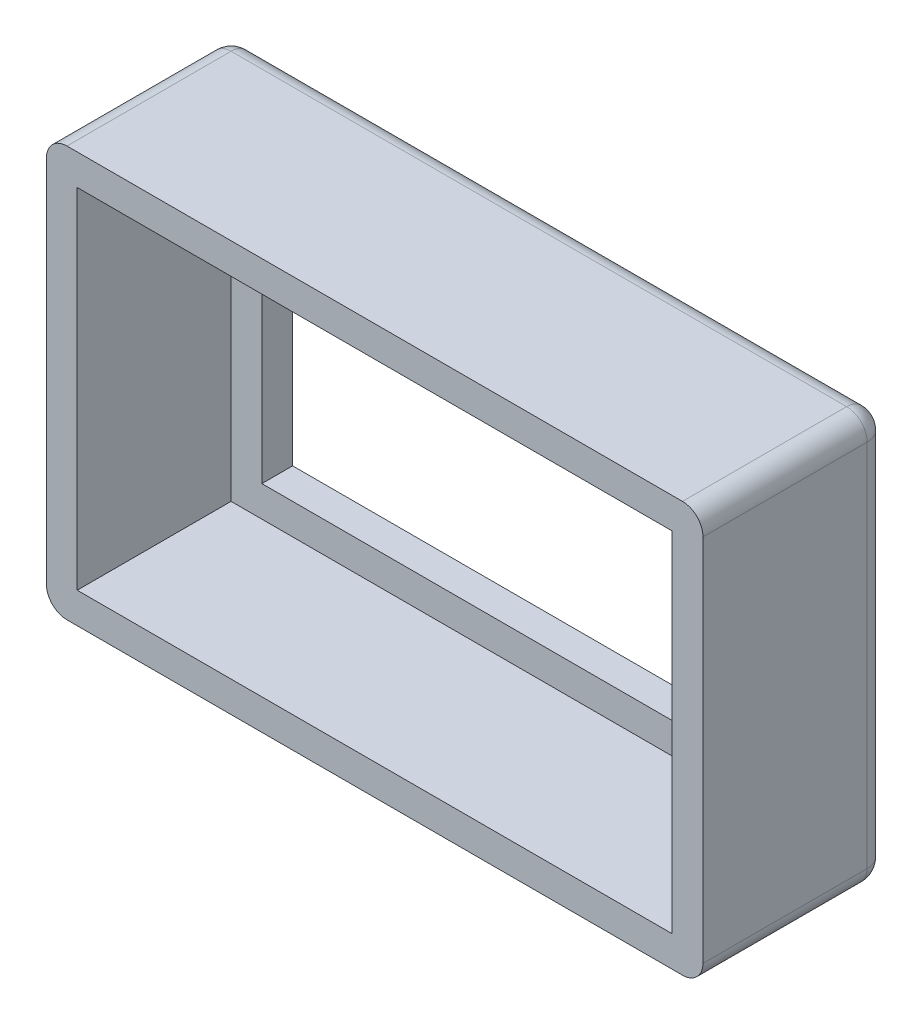
ISO-10303-21;
HEADER;
FILE_DESCRIPTION(('STEP AP214'),'2;1');
FILE_NAME('part.step','',(''),(''),'','','');
FILE_SCHEMA(('AUTOMOTIVE_DESIGN { 1 0 10303 214 1 1 1 1 }'));
ENDSEC;
DATA;
#1=APPLICATION_CONTEXT('core data for automotive mechanical design processes');
#2=APPLICATION_PROTOCOL_DEFINITION('international standard','automotive_design',2000,#1);
#3=PRODUCT_CONTEXT('',#1,'mechanical');
#4=PRODUCT('Part','Part','',(#3));
#5=PRODUCT_RELATED_PRODUCT_CATEGORY('part','',(#4));
#6=PRODUCT_DEFINITION_FORMATION('','',#4);
#7=PRODUCT_DEFINITION_CONTEXT('part definition',#1,'design');
#8=PRODUCT_DEFINITION('design','',#6,#7);
#9=PRODUCT_DEFINITION_SHAPE('','',#8);
#10=(LENGTH_UNIT() NAMED_UNIT(*) SI_UNIT(.MILLI.,.METRE.));
#11=(NAMED_UNIT(*) PLANE_ANGLE_UNIT() SI_UNIT($,.RADIAN.));
#12=(NAMED_UNIT(*) SI_UNIT($,.STERADIAN.) SOLID_ANGLE_UNIT());
#13=UNCERTAINTY_MEASURE_WITH_UNIT(LENGTH_MEASURE(1.E-05),#10,'distance_accuracy_value','');
#14=(GEOMETRIC_REPRESENTATION_CONTEXT(3) GLOBAL_UNCERTAINTY_ASSIGNED_CONTEXT((#13)) GLOBAL_UNIT_ASSIGNED_CONTEXT((#10,
#11,#12)) REPRESENTATION_CONTEXT('',''));
#15=CARTESIAN_POINT('',(0.,0.,0.));
#16=DIRECTION('',(0.,0.,1.));
#17=DIRECTION('',(1.,0.,0.));
#18=AXIS2_PLACEMENT_3D('',#15,#16,#17);
#19=CARTESIAN_POINT('',(29.4640000000033,-66.5479999999989,-4.57199999997471));
#20=DIRECTION('',(1.,0.,0.));
#21=DIRECTION('',(0.,0.,-1.));
#22=AXIS2_PLACEMENT_3D('',#19,#20,#21);
#23=PLANE('',#22);
#24=DIRECTION('',(0.,-1.,0.));
#25=VECTOR('',#24,1.);
#26=CARTESIAN_POINT('',(29.4640000000033,-66.5479999999912,-3.80999999998544));
#27=LINE('',#26,#25);
#28=CARTESIAN_POINT('',(29.4640000000033,-59.4359999999972,-3.80999999998988));
#29=VERTEX_POINT('',#28);
#30=CARTESIAN_POINT('',(29.4640000000033,-66.5479999999912,-3.80999999998544));
#31=VERTEX_POINT('',#30);
#32=EDGE_CURVE('E206',#29,#31,#27,.T.);
#33=ORIENTED_EDGE('',*,*,#32,.F.);
#34=DIRECTION('',(0.,0.,1.));
#35=VECTOR('',#34,1.);
#36=CARTESIAN_POINT('',(29.4640000000033,-59.4359999999909,-4.57199999998359));
#37=LINE('',#36,#35);
#38=CARTESIAN_POINT('',(29.4640000000033,-59.4359999999909,-4.57199999998359));
#39=VERTEX_POINT('',#38);
#40=EDGE_CURVE('E220',#39,#29,#37,.T.);
#41=ORIENTED_EDGE('',*,*,#40,.F.);
#42=DIRECTION('',(0.,1.,0.));
#43=VECTOR('',#42,1.);
#44=CARTESIAN_POINT('',(29.4640000000033,-66.5479999999989,-4.57199999997471));
#45=LINE('',#44,#43);
#46=CARTESIAN_POINT('',(29.4640000000033,-66.5479999999989,-4.57199999997471));
#47=VERTEX_POINT('',#46);
#48=EDGE_CURVE('E208',#47,#39,#45,.T.);
#49=ORIENTED_EDGE('',*,*,#48,.F.);
#50=DIRECTION('',(0.,0.,1.));
#51=VECTOR('',#50,1.);
#52=CARTESIAN_POINT('',(29.4640000000033,-66.5479999999989,-4.57199999997471));
#53=LINE('',#52,#51);
#54=EDGE_CURVE('E221',#47,#31,#53,.T.);
#55=ORIENTED_EDGE('',*,*,#54,.T.);
#56=EDGE_LOOP('',(#33,#41,#49,#55));
#57=FACE_BOUND('',#56,.T.);
#58=ADVANCED_FACE('F38',(#57),#23,.F.);
#59=CARTESIAN_POINT('',(16.2560000000033,-66.5479999999989,-4.57199999997471));
#60=DIRECTION('',(0.,-1.,0.));
#61=DIRECTION('',(0.,0.,-1.));
#62=AXIS2_PLACEMENT_3D('',#59,#60,#61);
#63=PLANE('',#62);
#64=DIRECTION('',(-1.,0.,0.));
#65=VECTOR('',#64,1.);
#66=CARTESIAN_POINT('',(16.2560000000033,-66.5479999999912,-3.80999999998544));
#67=LINE('',#66,#65);
#68=CARTESIAN_POINT('',(16.2560000000033,-66.5479999999912,-3.80999999998544));
#69=VERTEX_POINT('',#68);
#70=EDGE_CURVE('E204',#31,#69,#67,.T.);
#71=ORIENTED_EDGE('',*,*,#70,.F.);
#72=ORIENTED_EDGE('',*,*,#54,.F.);
#73=DIRECTION('',(1.,0.,0.));
#74=VECTOR('',#73,1.);
#75=CARTESIAN_POINT('',(16.2560000000033,-66.5479999999989,-4.57199999997471));
#76=LINE('',#75,#74);
#77=CARTESIAN_POINT('',(16.2560000000033,-66.5479999999989,-4.57199999997471));
#78=VERTEX_POINT('',#77);
#79=EDGE_CURVE('E217',#78,#47,#76,.T.);
#80=ORIENTED_EDGE('',*,*,#79,.F.);
#81=DIRECTION('',(0.,0.,1.));
#82=VECTOR('',#81,1.);
#83=CARTESIAN_POINT('',(16.2560000000033,-66.5479999999989,-4.57199999997471));
#84=LINE('',#83,#82);
#85=EDGE_CURVE('E225',#78,#69,#84,.T.);
#86=ORIENTED_EDGE('',*,*,#85,.T.);
#87=EDGE_LOOP('',(#71,#72,#80,#86));
#88=FACE_BOUND('',#87,.T.);
#89=ADVANCED_FACE('F341',(#88),#63,.F.);
#90=CARTESIAN_POINT('',(16.2560000000033,-59.4359999999909,-4.57199999998359));
#91=DIRECTION('',(-1.,0.,0.));
#92=DIRECTION('',(0.,0.,1.));
#93=AXIS2_PLACEMENT_3D('',#90,#91,#92);
#94=PLANE('',#93);
#95=DIRECTION('',(0.,1.,0.));
#96=VECTOR('',#95,1.);
#97=CARTESIAN_POINT('',(16.2560000000033,-59.4359999999972,-3.80999999998988));
#98=LINE('',#97,#96);
#99=CARTESIAN_POINT('',(16.2560000000033,-59.4359999999972,-3.80999999998988));
#100=VERTEX_POINT('',#99);
#101=EDGE_CURVE('E201',#69,#100,#98,.T.);
#102=ORIENTED_EDGE('',*,*,#101,.F.);
#103=ORIENTED_EDGE('',*,*,#85,.F.);
#104=DIRECTION('',(0.,-1.,0.));
#105=VECTOR('',#104,1.);
#106=CARTESIAN_POINT('',(16.2560000000033,-59.4359999999909,-4.57199999998359));
#107=LINE('',#106,#105);
#108=CARTESIAN_POINT('',(16.2560000000033,-59.4359999999909,-4.57199999998359));
#109=VERTEX_POINT('',#108);
#110=EDGE_CURVE('E214',#109,#78,#107,.T.);
#111=ORIENTED_EDGE('',*,*,#110,.F.);
#112=DIRECTION('',(0.,0.,1.));
#113=VECTOR('',#112,1.);
#114=CARTESIAN_POINT('',(16.2560000000033,-59.4359999999909,-4.57199999998359));
#115=LINE('',#114,#113);
#116=EDGE_CURVE('E228',#109,#100,#115,.T.);
#117=ORIENTED_EDGE('',*,*,#116,.T.);
#118=EDGE_LOOP('',(#102,#103,#111,#117));
#119=FACE_BOUND('',#118,.T.);
#120=ADVANCED_FACE('F347',(#119),#94,.F.);
#121=CARTESIAN_POINT('',(29.4640000000033,-59.4359999999909,-4.57199999998359));
#122=DIRECTION('',(0.,1.,0.));
#123=DIRECTION('',(-1.,0.,0.));
#124=AXIS2_PLACEMENT_3D('',#121,#122,#123);
#125=PLANE('',#124);
#126=DIRECTION('',(1.,0.,0.));
#127=VECTOR('',#126,1.);
#128=CARTESIAN_POINT('',(29.4640000000033,-59.4359999999972,-3.80999999998988));
#129=LINE('',#128,#127);
#130=EDGE_CURVE('E244',#100,#29,#129,.T.);
#131=ORIENTED_EDGE('',*,*,#130,.F.);
#132=ORIENTED_EDGE('',*,*,#116,.F.);
#133=DIRECTION('',(-1.,0.,0.));
#134=VECTOR('',#133,1.);
#135=CARTESIAN_POINT('',(29.4640000000033,-59.4359999999909,-4.57199999998359));
#136=LINE('',#135,#134);
#137=EDGE_CURVE('E211',#39,#109,#136,.T.);
#138=ORIENTED_EDGE('',*,*,#137,.F.);
#139=ORIENTED_EDGE('',*,*,#40,.T.);
#140=EDGE_LOOP('',(#131,#132,#138,#139));
#141=FACE_BOUND('',#140,.T.);
#142=ADVANCED_FACE('F352',(#141),#125,.F.);
#143=CARTESIAN_POINT('',(30.9880000000033,-68.0719999999919,-4.57199999998537));
#144=DIRECTION('',(1.,0.,0.));
#145=DIRECTION('',(0.,0.,-1.));
#146=AXIS2_PLACEMENT_3D('',#143,#144,#145);
#147=PLANE('',#146);
#148=DIRECTION('',(0.,1.,0.));
#149=VECTOR('',#148,1.);
#150=CARTESIAN_POINT('',(30.9880000000033,-57.9120000000009,-4.06399999999518));
#151=LINE('',#150,#149);
#152=CARTESIAN_POINT('',(30.9880000000033,-67.563999999994,-4.06399999999074));
#153=VERTEX_POINT('',#152);
#154=CARTESIAN_POINT('',(30.9880000000033,-58.4199999999973,-4.06399999999785));
#155=VERTEX_POINT('',#154);
#156=EDGE_CURVE('E248',#153,#155,#151,.T.);
#157=ORIENTED_EDGE('',*,*,#156,.T.);
#158=DIRECTION('',(0.,0.,1.));
#159=VECTOR('',#158,1.);
#160=CARTESIAN_POINT('',(30.9880000000033,-58.4199999999999,-4.57199999999247));
#161=LINE('',#160,#159);
#162=CARTESIAN_POINT('',(30.9880000000033,-58.4199999999937,8.88178419700125E-13));
#163=VERTEX_POINT('',#162);
#164=EDGE_CURVE('E251',#155,#163,#161,.T.);
#165=ORIENTED_EDGE('',*,*,#164,.T.);
#166=DIRECTION('',(0.,1.,0.));
#167=VECTOR('',#166,1.);
#168=CARTESIAN_POINT('',(30.9880000000033,-68.0719999999984,4.44089209850063E-12));
#169=LINE('',#168,#167);
#170=CARTESIAN_POINT('',(30.9880000000033,-67.5639999999948,8.88178419700125E-13));
#171=VERTEX_POINT('',#170);
#172=EDGE_CURVE('E224',#171,#163,#169,.T.);
#173=ORIENTED_EDGE('',*,*,#172,.F.);
#174=DIRECTION('',(0.,0.,1.));
#175=VECTOR('',#174,1.);
#176=CARTESIAN_POINT('',(30.9880000000033,-67.5639999999962,-4.57199999999425));
#177=LINE('',#176,#175);
#178=EDGE_CURVE('E246',#171,#153,#177,.F.);
#179=ORIENTED_EDGE('',*,*,#178,.T.);
#180=EDGE_LOOP('',(#157,#165,#173,#179));
#181=FACE_BOUND('',#180,.T.);
#182=ADVANCED_FACE('F365',(#181),#147,.T.);
#183=CARTESIAN_POINT('',(14.7320000000033,-68.0719999999919,-4.57199999998537));
#184=DIRECTION('',(0.,-1.,0.));
#185=DIRECTION('',(0.,0.,-1.));
#186=AXIS2_PLACEMENT_3D('',#183,#184,#185);
#187=PLANE('',#186);
#188=DIRECTION('',(1.,0.,0.));
#189=VECTOR('',#188,1.);
#190=CARTESIAN_POINT('',(14.7320000000033,-68.0719999999984,4.44089209850063E-12));
#191=LINE('',#190,#189);
#192=CARTESIAN_POINT('',(15.2400000000033,-68.0719999999984,4.44089209850063E-12));
#193=VERTEX_POINT('',#192);
#194=CARTESIAN_POINT('',(30.4800000000033,-68.0719999999984,4.44089209850063E-12));
#195=VERTEX_POINT('',#194);
#196=EDGE_CURVE('E241',#193,#195,#191,.T.);
#197=ORIENTED_EDGE('',*,*,#196,.F.);
#198=DIRECTION('',(0.,0.,1.));
#199=VECTOR('',#198,1.);
#200=CARTESIAN_POINT('',(15.2400000000033,-68.0719999999919,-4.57199999998537));
#201=LINE('',#200,#199);
#202=CARTESIAN_POINT('',(15.2400000000033,-68.0719999999977,-4.06399999999785));
#203=VERTEX_POINT('',#202);
#204=EDGE_CURVE('E55',#193,#203,#201,.F.);
#205=ORIENTED_EDGE('',*,*,#204,.T.);
#206=DIRECTION('',(1.,0.,0.));
#207=VECTOR('',#206,1.);
#208=CARTESIAN_POINT('',(30.9880000000033,-68.0719999999977,-4.06399999999785));
#209=LINE('',#208,#207);
#210=CARTESIAN_POINT('',(30.4800000000033,-68.0719999999977,-4.06399999999785));
#211=VERTEX_POINT('',#210);
#212=EDGE_CURVE('E60',#203,#211,#209,.T.);
#213=ORIENTED_EDGE('',*,*,#212,.T.);
#214=DIRECTION('',(0.,0.,1.));
#215=VECTOR('',#214,1.);
#216=CARTESIAN_POINT('',(30.4800000000033,-68.0719999999919,-4.57199999998537));
#217=LINE('',#216,#215);
#218=EDGE_CURVE('E274',#211,#195,#217,.T.);
#219=ORIENTED_EDGE('',*,*,#218,.T.);
#220=EDGE_LOOP('',(#197,#205,#213,#219));
#221=FACE_BOUND('',#220,.T.);
#222=ADVANCED_FACE('F361',(#221),#187,.T.);
#223=CARTESIAN_POINT('',(14.7320000000033,-57.9119999999982,-4.57199999999425));
#224=DIRECTION('',(-1.,0.,0.));
#225=DIRECTION('',(0.,-1.,0.));
#226=AXIS2_PLACEMENT_3D('',#223,#224,#225);
#227=PLANE('',#226);
#228=DIRECTION('',(0.,-1.,0.));
#229=VECTOR('',#228,1.);
#230=CARTESIAN_POINT('',(14.7320000000033,-57.9119999999991,-8.88178419700125E-13));
#231=LINE('',#230,#229);
#232=CARTESIAN_POINT('',(14.7320000000033,-58.4199999999937,8.88178419700125E-13));
#233=VERTEX_POINT('',#232);
#234=CARTESIAN_POINT('',(14.7320000000033,-67.5639999999948,8.88178419700125E-13));
#235=VERTEX_POINT('',#234);
#236=EDGE_CURVE('E238',#233,#235,#231,.T.);
#237=ORIENTED_EDGE('',*,*,#236,.F.);
#238=DIRECTION('',(0.,0.,1.));
#239=VECTOR('',#238,1.);
#240=CARTESIAN_POINT('',(14.7320000000033,-58.4199999999999,-4.57199999999247));
#241=LINE('',#240,#239);
#242=CARTESIAN_POINT('',(14.7320000000033,-58.4199999999973,-4.06399999999607));
#243=VERTEX_POINT('',#242);
#244=EDGE_CURVE('E272',#233,#243,#241,.F.);
#245=ORIENTED_EDGE('',*,*,#244,.T.);
#246=DIRECTION('',(0.,-1.,0.));
#247=VECTOR('',#246,1.);
#248=CARTESIAN_POINT('',(14.7320000000033,-68.0719999999977,-4.06399999999785));
#249=LINE('',#248,#247);
#250=CARTESIAN_POINT('',(14.7320000000033,-67.563999999994,-4.06399999999074));
#251=VERTEX_POINT('',#250);
#252=EDGE_CURVE('E270',#243,#251,#249,.T.);
#253=ORIENTED_EDGE('',*,*,#252,.T.);
#254=DIRECTION('',(0.,0.,1.));
#255=VECTOR('',#254,1.);
#256=CARTESIAN_POINT('',(14.7320000000033,-67.5639999999962,-4.57199999999425));
#257=LINE('',#256,#255);
#258=EDGE_CURVE('E268',#251,#235,#257,.T.);
#259=ORIENTED_EDGE('',*,*,#258,.T.);
#260=EDGE_LOOP('',(#237,#245,#253,#259));
#261=FACE_BOUND('',#260,.T.);
#262=ADVANCED_FACE('F364',(#261),#227,.T.);
#263=CARTESIAN_POINT('',(30.9880000000033,-57.9119999999982,-4.57199999999425));
#264=DIRECTION('',(0.,1.,0.));
#265=DIRECTION('',(-1.,0.,0.));
#266=AXIS2_PLACEMENT_3D('',#263,#264,#265);
#267=PLANE('',#266);
#268=DIRECTION('',(-1.,0.,0.));
#269=VECTOR('',#268,1.);
#270=CARTESIAN_POINT('',(14.7320000000033,-57.9120000000009,-4.06399999999607));
#271=LINE('',#270,#269);
#272=CARTESIAN_POINT('',(30.4800000000033,-57.9120000000009,-4.06399999999518));
#273=VERTEX_POINT('',#272);
#274=CARTESIAN_POINT('',(15.2400000000033,-57.9120000000009,-4.06399999999607));
#275=VERTEX_POINT('',#274);
#276=EDGE_CURVE('E264',#273,#275,#271,.T.);
#277=ORIENTED_EDGE('',*,*,#276,.T.);
#278=DIRECTION('',(0.,0.,1.));
#279=VECTOR('',#278,1.);
#280=CARTESIAN_POINT('',(15.2400000000033,-57.9119999999982,-4.57199999999425));
#281=LINE('',#280,#279);
#282=CARTESIAN_POINT('',(15.2400000000033,-57.9119999999991,-8.88178419700125E-13));
#283=VERTEX_POINT('',#282);
#284=EDGE_CURVE('E266',#275,#283,#281,.T.);
#285=ORIENTED_EDGE('',*,*,#284,.T.);
#286=DIRECTION('',(-1.,0.,0.));
#287=VECTOR('',#286,1.);
#288=CARTESIAN_POINT('',(30.9880000000033,-57.9119999999991,-8.88178419700125E-13));
#289=LINE('',#288,#287);
#290=CARTESIAN_POINT('',(30.4800000000033,-57.9119999999991,-8.88178419700125E-13));
#291=VERTEX_POINT('',#290);
#292=EDGE_CURVE('E235',#291,#283,#289,.T.);
#293=ORIENTED_EDGE('',*,*,#292,.F.);
#294=DIRECTION('',(0.,0.,1.));
#295=VECTOR('',#294,1.);
#296=CARTESIAN_POINT('',(30.4800000000033,-57.9119999999982,-4.57199999999425));
#297=LINE('',#296,#295);
#298=EDGE_CURVE('E262',#291,#273,#297,.F.);
#299=ORIENTED_EDGE('',*,*,#298,.T.);
#300=EDGE_LOOP('',(#277,#285,#293,#299));
#301=FACE_BOUND('',#300,.T.);
#302=ADVANCED_FACE('F357',(#301),#267,.T.);
#303=CARTESIAN_POINT('',(-4.44089209850063E-13,-8.88178419700125E-13,-4.57199999999158));
#304=DIRECTION('',(0.,0.,1.));
#305=DIRECTION('',(1.,0.,0.));
#306=AXIS2_PLACEMENT_3D('',#303,#304,#305);
#307=PLANE('',#306);
#308=DIRECTION('',(-1.,0.,0.));
#309=VECTOR('',#308,1.);
#310=CARTESIAN_POINT('',(30.9880000000033,-58.4199999999999,-4.57199999999247));
#311=LINE('',#310,#309);
#312=CARTESIAN_POINT('',(15.2400000000033,-58.4199999999999,-4.57199999999247));
#313=VERTEX_POINT('',#312);
#314=CARTESIAN_POINT('',(30.4800000000033,-58.4199999999999,-4.57199999999247));
#315=VERTEX_POINT('',#314);
#316=EDGE_CURVE('E257',#313,#315,#311,.F.);
#317=ORIENTED_EDGE('',*,*,#316,.T.);
#318=DIRECTION('',(0.,1.,0.));
#319=VECTOR('',#318,1.);
#320=CARTESIAN_POINT('',(30.4800000000033,-68.0719999999919,-4.57199999998537));
#321=LINE('',#320,#319);
#322=CARTESIAN_POINT('',(30.4800000000033,-67.5639999999962,-4.57199999999425));
#323=VERTEX_POINT('',#322);
#324=EDGE_CURVE('E259',#315,#323,#321,.F.);
#325=ORIENTED_EDGE('',*,*,#324,.T.);
#326=DIRECTION('',(1.,0.,0.));
#327=VECTOR('',#326,1.);
#328=CARTESIAN_POINT('',(14.7320000000033,-67.5639999999962,-4.57199999999425));
#329=LINE('',#328,#327);
#330=CARTESIAN_POINT('',(15.2400000000033,-67.5639999999962,-4.57199999999425));
#331=VERTEX_POINT('',#330);
#332=EDGE_CURVE('E253',#323,#331,#329,.F.);
#333=ORIENTED_EDGE('',*,*,#332,.T.);
#334=DIRECTION('',(0.,-1.,0.));
#335=VECTOR('',#334,1.);
#336=CARTESIAN_POINT('',(15.2400000000033,-57.9119999999982,-4.57199999999425));
#337=LINE('',#336,#335);
#338=EDGE_CURVE('E255',#331,#313,#337,.F.);
#339=ORIENTED_EDGE('',*,*,#338,.T.);
#340=EDGE_LOOP('',(#317,#325,#333,#339));
#341=FACE_BOUND('',#340,.T.);
#342=ORIENTED_EDGE('',*,*,#79,.T.);
#343=ORIENTED_EDGE('',*,*,#48,.T.);
#344=ORIENTED_EDGE('',*,*,#137,.T.);
#345=ORIENTED_EDGE('',*,*,#110,.T.);
#346=EDGE_LOOP('',(#342,#343,#344,#345));
#347=FACE_BOUND('',#346,.T.);
#348=ADVANCED_FACE('F354',(#341,#347),#307,.F.);
#349=CARTESIAN_POINT('',(0.,0.,0.));
#350=DIRECTION('',(0.,0.,1.));
#351=DIRECTION('',(1.,0.,0.));
#352=AXIS2_PLACEMENT_3D('',#349,#350,#351);
#353=PLANE('',#352);
#354=DIRECTION('',(0.,-1.,0.));
#355=VECTOR('',#354,1.);
#356=CARTESIAN_POINT('',(15.4940000000033,-58.673999999999,0.));
#357=LINE('',#356,#355);
#358=CARTESIAN_POINT('',(15.4940000000033,-58.673999999999,0.));
#359=VERTEX_POINT('',#358);
#360=CARTESIAN_POINT('',(15.4940000000033,-67.3099999999991,0.));
#361=VERTEX_POINT('',#360);
#362=EDGE_CURVE('E185',#359,#361,#357,.T.);
#363=ORIENTED_EDGE('',*,*,#362,.F.);
#364=DIRECTION('',(-1.,0.,0.));
#365=VECTOR('',#364,1.);
#366=CARTESIAN_POINT('',(15.4940000000033,-58.673999999999,0.));
#367=LINE('',#366,#365);
#368=CARTESIAN_POINT('',(30.2260000000033,-58.673999999999,0.));
#369=VERTEX_POINT('',#368);
#370=EDGE_CURVE('E190',#369,#359,#367,.T.);
#371=ORIENTED_EDGE('',*,*,#370,.F.);
#372=DIRECTION('',(0.,1.,0.));
#373=VECTOR('',#372,1.);
#374=CARTESIAN_POINT('',(30.2260000000033,-58.673999999999,0.));
#375=LINE('',#374,#373);
#376=CARTESIAN_POINT('',(30.2260000000033,-67.3099999999991,0.));
#377=VERTEX_POINT('',#376);
#378=EDGE_CURVE('E169',#377,#369,#375,.T.);
#379=ORIENTED_EDGE('',*,*,#378,.F.);
#380=DIRECTION('',(1.,0.,0.));
#381=VECTOR('',#380,1.);
#382=CARTESIAN_POINT('',(15.4940000000033,-67.3099999999991,0.));
#383=LINE('',#382,#381);
#384=EDGE_CURVE('E180',#361,#377,#383,.T.);
#385=ORIENTED_EDGE('',*,*,#384,.F.);
#386=EDGE_LOOP('',(#363,#371,#379,#385));
#387=FACE_BOUND('',#386,.T.);
#388=ORIENTED_EDGE('',*,*,#292,.T.);
#389=CARTESIAN_POINT('',(15.2400000000033,-58.4199999999937,8.88178419700125E-13));
#390=DIRECTION('',(0.,0.,1.));
#391=DIRECTION('',(1.,0.,0.));
#392=AXIS2_PLACEMENT_3D('',#389,#390,#391);
#393=CIRCLE('',#392,0.508);
#394=EDGE_CURVE('E12',#283,#233,#393,.T.);
#395=ORIENTED_EDGE('',*,*,#394,.T.);
#396=ORIENTED_EDGE('',*,*,#236,.T.);
#397=CARTESIAN_POINT('',(15.2400000000033,-67.5639999999948,8.88178419700125E-13));
#398=DIRECTION('',(0.,0.,1.));
#399=DIRECTION('',(1.,0.,0.));
#400=AXIS2_PLACEMENT_3D('',#397,#398,#399);
#401=CIRCLE('',#400,0.508);
#402=EDGE_CURVE('E280',#235,#193,#401,.T.);
#403=ORIENTED_EDGE('',*,*,#402,.T.);
#404=ORIENTED_EDGE('',*,*,#196,.T.);
#405=CARTESIAN_POINT('',(30.4800000000033,-67.5639999999948,8.88178419700125E-13));
#406=DIRECTION('',(0.,0.,1.));
#407=DIRECTION('',(1.,0.,0.));
#408=AXIS2_PLACEMENT_3D('',#405,#406,#407);
#409=CIRCLE('',#408,0.508);
#410=EDGE_CURVE('E278',#195,#171,#409,.T.);
#411=ORIENTED_EDGE('',*,*,#410,.T.);
#412=ORIENTED_EDGE('',*,*,#172,.T.);
#413=CARTESIAN_POINT('',(30.4800000000033,-58.4199999999937,8.88178419700125E-13));
#414=DIRECTION('',(0.,0.,1.));
#415=DIRECTION('',(1.,0.,0.));
#416=AXIS2_PLACEMENT_3D('',#413,#414,#415);
#417=CIRCLE('',#416,0.508);
#418=EDGE_CURVE('E47',#163,#291,#417,.T.);
#419=ORIENTED_EDGE('',*,*,#418,.T.);
#420=EDGE_LOOP('',(#388,#395,#396,#403,#404,#411,#412,#419));
#421=FACE_BOUND('',#420,.T.);
#422=ADVANCED_FACE('F187',(#387,#421),#353,.T.);
#423=CARTESIAN_POINT('',(-2.22044604925031E-13,5.32907051820075E-12,-3.80999999999787));
#424=DIRECTION('',(0.,0.,1.));
#425=DIRECTION('',(1.,0.,0.));
#426=AXIS2_PLACEMENT_3D('',#423,#424,#425);
#427=PLANE('',#426);
#428=DIRECTION('',(0.,1.,0.));
#429=VECTOR('',#428,1.);
#430=CARTESIAN_POINT('',(15.4940000000033,-58.6739999999963,-3.80999999999609));
#431=LINE('',#430,#429);
#432=CARTESIAN_POINT('',(15.4940000000033,-67.3099999999911,-3.80999999997833));
#433=VERTEX_POINT('',#432);
#434=CARTESIAN_POINT('',(15.4940000000033,-58.6739999999963,-3.80999999999609));
#435=VERTEX_POINT('',#434);
#436=EDGE_CURVE('E202',#433,#435,#431,.T.);
#437=ORIENTED_EDGE('',*,*,#436,.F.);
#438=DIRECTION('',(-1.,0.,0.));
#439=VECTOR('',#438,1.);
#440=CARTESIAN_POINT('',(15.4940000000033,-67.3099999999911,-3.80999999997833));
#441=LINE('',#440,#439);
#442=CARTESIAN_POINT('',(30.2260000000033,-67.3099999999911,-3.80999999997833));
#443=VERTEX_POINT('',#442);
#444=EDGE_CURVE('E199',#443,#433,#441,.T.);
#445=ORIENTED_EDGE('',*,*,#444,.F.);
#446=DIRECTION('',(0.,-1.,0.));
#447=VECTOR('',#446,1.);
#448=CARTESIAN_POINT('',(30.2260000000033,-58.6739999999963,-3.80999999999609));
#449=LINE('',#448,#447);
#450=CARTESIAN_POINT('',(30.2260000000033,-58.6739999999963,-3.80999999999609));
#451=VERTEX_POINT('',#450);
#452=EDGE_CURVE('E172',#451,#443,#449,.T.);
#453=ORIENTED_EDGE('',*,*,#452,.F.);
#454=DIRECTION('',(1.,0.,0.));
#455=VECTOR('',#454,1.);
#456=CARTESIAN_POINT('',(15.4940000000033,-58.6739999999963,-3.80999999999609));
#457=LINE('',#456,#455);
#458=EDGE_CURVE('E319',#435,#451,#457,.T.);
#459=ORIENTED_EDGE('',*,*,#458,.F.);
#460=EDGE_LOOP('',(#437,#445,#453,#459));
#461=FACE_BOUND('',#460,.T.);
#462=ORIENTED_EDGE('',*,*,#32,.T.);
#463=ORIENTED_EDGE('',*,*,#70,.T.);
#464=ORIENTED_EDGE('',*,*,#101,.T.);
#465=ORIENTED_EDGE('',*,*,#130,.T.);
#466=EDGE_LOOP('',(#462,#463,#464,#465));
#467=FACE_BOUND('',#466,.T.);
#468=ADVANCED_FACE('F327',(#461,#467),#427,.T.);
#469=CARTESIAN_POINT('',(15.4940000000033,-58.6739999999937,-21.6486600949937));
#470=DIRECTION('',(-1.,0.,0.));
#471=DIRECTION('',(0.,-1.,0.));
#472=AXIS2_PLACEMENT_3D('',#469,#470,#471);
#473=PLANE('',#472);
#474=ORIENTED_EDGE('',*,*,#436,.T.);
#475=DIRECTION('',(0.,0.,1.));
#476=VECTOR('',#475,1.);
#477=CARTESIAN_POINT('',(15.4940000000033,-58.6739999999937,-21.6486600949937));
#478=LINE('',#477,#476);
#479=EDGE_CURVE('E195',#435,#359,#478,.T.);
#480=ORIENTED_EDGE('',*,*,#479,.T.);
#481=ORIENTED_EDGE('',*,*,#362,.T.);
#482=DIRECTION('',(0.,0.,1.));
#483=VECTOR('',#482,1.);
#484=CARTESIAN_POINT('',(15.4940000000033,-67.3099999999991,-21.6486600949928));
#485=LINE('',#484,#483);
#486=EDGE_CURVE('E176',#433,#361,#485,.T.);
#487=ORIENTED_EDGE('',*,*,#486,.F.);
#488=EDGE_LOOP('',(#474,#480,#481,#487));
#489=FACE_BOUND('',#488,.T.);
#490=ADVANCED_FACE('F329',(#489),#473,.F.);
#491=CARTESIAN_POINT('',(15.4940000000033,-58.6739999999937,-21.6486600949937));
#492=DIRECTION('',(0.,1.,0.));
#493=DIRECTION('',(0.,0.,1.));
#494=AXIS2_PLACEMENT_3D('',#491,#492,#493);
#495=PLANE('',#494);
#496=ORIENTED_EDGE('',*,*,#458,.T.);
#497=DIRECTION('',(0.,0.,1.));
#498=VECTOR('',#497,1.);
#499=CARTESIAN_POINT('',(30.2260000000033,-58.6739999999937,-21.6486600949937));
#500=LINE('',#499,#498);
#501=EDGE_CURVE('E175',#451,#369,#500,.T.);
#502=ORIENTED_EDGE('',*,*,#501,.T.);
#503=ORIENTED_EDGE('',*,*,#370,.T.);
#504=ORIENTED_EDGE('',*,*,#479,.F.);
#505=EDGE_LOOP('',(#496,#502,#503,#504));
#506=FACE_BOUND('',#505,.T.);
#507=ADVANCED_FACE('F324',(#506),#495,.F.);
#508=CARTESIAN_POINT('',(30.2260000000033,-58.6739999999937,-21.6486600949937));
#509=DIRECTION('',(1.,0.,0.));
#510=DIRECTION('',(0.,1.,0.));
#511=AXIS2_PLACEMENT_3D('',#508,#509,#510);
#512=PLANE('',#511);
#513=ORIENTED_EDGE('',*,*,#452,.T.);
#514=DIRECTION('',(0.,0.,1.));
#515=VECTOR('',#514,1.);
#516=CARTESIAN_POINT('',(30.2260000000033,-67.3099999999991,-21.6486600949928));
#517=LINE('',#516,#515);
#518=EDGE_CURVE('E164',#443,#377,#517,.T.);
#519=ORIENTED_EDGE('',*,*,#518,.T.);
#520=ORIENTED_EDGE('',*,*,#378,.T.);
#521=ORIENTED_EDGE('',*,*,#501,.F.);
#522=EDGE_LOOP('',(#513,#519,#520,#521));
#523=FACE_BOUND('',#522,.T.);
#524=ADVANCED_FACE('F166',(#523),#512,.F.);
#525=CARTESIAN_POINT('',(15.4940000000033,-67.3099999999991,-21.6486600949928));
#526=DIRECTION('',(0.,-1.,0.));
#527=DIRECTION('',(1.,0.,0.));
#528=AXIS2_PLACEMENT_3D('',#525,#526,#527);
#529=PLANE('',#528);
#530=ORIENTED_EDGE('',*,*,#444,.T.);
#531=ORIENTED_EDGE('',*,*,#486,.T.);
#532=ORIENTED_EDGE('',*,*,#384,.T.);
#533=ORIENTED_EDGE('',*,*,#518,.F.);
#534=EDGE_LOOP('',(#530,#531,#532,#533));
#535=FACE_BOUND('',#534,.T.);
#536=ADVANCED_FACE('F181',(#535),#529,.F.);
#537=CARTESIAN_POINT('',(15.2400000000033,-67.5639999999962,-4.57199999999425));
#538=DIRECTION('',(0.,0.,1.));
#539=DIRECTION('',(1.,0.,0.));
#540=AXIS2_PLACEMENT_3D('',#537,#538,#539);
#541=CYLINDRICAL_SURFACE('',#540,0.508);
#542=ORIENTED_EDGE('',*,*,#402,.F.);
#543=ORIENTED_EDGE('',*,*,#258,.F.);
#544=CARTESIAN_POINT('',(15.2400000000033,-67.563999999994,-4.06399999999074));
#545=DIRECTION('',(0.,0.,-1.));
#546=DIRECTION('',(-1.,0.,0.));
#547=AXIS2_PLACEMENT_3D('',#544,#545,#546);
#548=CIRCLE('',#547,0.508);
#549=EDGE_CURVE('E310',#203,#251,#548,.T.);
#550=ORIENTED_EDGE('',*,*,#549,.F.);
#551=ORIENTED_EDGE('',*,*,#204,.F.);
#552=EDGE_LOOP('',(#542,#543,#550,#551));
#553=FACE_BOUND('',#552,.T.);
#554=ADVANCED_FACE('F40',(#553),#541,.T.);
#555=CARTESIAN_POINT('',(15.2400000000033,-58.4199999999999,-4.57199999999247));
#556=DIRECTION('',(0.,0.,1.));
#557=DIRECTION('',(1.,0.,0.));
#558=AXIS2_PLACEMENT_3D('',#555,#556,#557);
#559=CYLINDRICAL_SURFACE('',#558,0.508);
#560=ORIENTED_EDGE('',*,*,#394,.F.);
#561=ORIENTED_EDGE('',*,*,#284,.F.);
#562=CARTESIAN_POINT('',(15.2400000000033,-58.4199999999973,-4.06399999999607));
#563=DIRECTION('',(0.,0.,-1.));
#564=DIRECTION('',(-1.,0.,0.));
#565=AXIS2_PLACEMENT_3D('',#562,#563,#564);
#566=CIRCLE('',#565,0.508);
#567=EDGE_CURVE('E308',#243,#275,#566,.T.);
#568=ORIENTED_EDGE('',*,*,#567,.F.);
#569=ORIENTED_EDGE('',*,*,#244,.F.);
#570=EDGE_LOOP('',(#560,#561,#568,#569));
#571=FACE_BOUND('',#570,.T.);
#572=ADVANCED_FACE('F412',(#571),#559,.T.);
#573=CARTESIAN_POINT('',(15.2400000000033,-57.9120000000009,-4.06399999999607));
#574=DIRECTION('',(0.,1.,0.));
#575=DIRECTION('',(-1.,0.,0.));
#576=AXIS2_PLACEMENT_3D('',#573,#574,#575);
#577=CYLINDRICAL_SURFACE('',#576,0.508);
#578=CARTESIAN_POINT('',(15.2400000000033,-67.563999999994,-4.06399999999074));
#579=DIRECTION('',(0.,-1.,0.));
#580=DIRECTION('',(0.,0.,-1.));
#581=AXIS2_PLACEMENT_3D('',#578,#579,#580);
#582=CIRCLE('',#581,0.508);
#583=EDGE_CURVE('E42',#251,#331,#582,.T.);
#584=ORIENTED_EDGE('',*,*,#583,.F.);
#585=ORIENTED_EDGE('',*,*,#252,.F.);
#586=CARTESIAN_POINT('',(15.2400000000033,-58.4199999999973,-4.06399999999607));
#587=DIRECTION('',(0.,1.,0.));
#588=DIRECTION('',(0.,0.,1.));
#589=AXIS2_PLACEMENT_3D('',#586,#587,#588);
#590=CIRCLE('',#589,0.508);
#591=EDGE_CURVE('E305',#313,#243,#590,.T.);
#592=ORIENTED_EDGE('',*,*,#591,.F.);
#593=ORIENTED_EDGE('',*,*,#338,.F.);
#594=EDGE_LOOP('',(#584,#585,#592,#593));
#595=FACE_BOUND('',#594,.T.);
#596=ADVANCED_FACE('F410',(#595),#577,.T.);
#597=CARTESIAN_POINT('',(15.2400000000033,-67.563999999994,-4.06399999999074));
#598=DIRECTION('',(0.,0.,1.));
#599=DIRECTION('',(1.,0.,0.));
#600=AXIS2_PLACEMENT_3D('',#597,#598,#599);
#601=SPHERICAL_SURFACE('',#600,0.508);
#602=ORIENTED_EDGE('',*,*,#549,.T.);
#603=ORIENTED_EDGE('',*,*,#583,.T.);
#604=CARTESIAN_POINT('',(15.2400000000033,-67.563999999994,-4.06399999999074));
#605=DIRECTION('',(-1.,0.,0.));
#606=DIRECTION('',(0.,0.,1.));
#607=AXIS2_PLACEMENT_3D('',#604,#605,#606);
#608=CIRCLE('',#607,0.508);
#609=EDGE_CURVE('E302',#203,#331,#608,.F.);
#610=ORIENTED_EDGE('',*,*,#609,.F.);
#611=EDGE_LOOP('',(#602,#603,#610));
#612=FACE_BOUND('',#611,.T.);
#613=ADVANCED_FACE('F406',(#612),#601,.T.);
#614=CARTESIAN_POINT('',(15.2400000000033,-58.4199999999973,-4.06399999999607));
#615=DIRECTION('',(0.,0.,1.));
#616=DIRECTION('',(1.,0.,0.));
#617=AXIS2_PLACEMENT_3D('',#614,#615,#616);
#618=SPHERICAL_SURFACE('',#617,0.508);
#619=ORIENTED_EDGE('',*,*,#591,.T.);
#620=ORIENTED_EDGE('',*,*,#567,.T.);
#621=CARTESIAN_POINT('',(15.2400000000033,-58.4199999999973,-4.06399999999607));
#622=DIRECTION('',(-1.,0.,0.));
#623=DIRECTION('',(0.,0.,1.));
#624=AXIS2_PLACEMENT_3D('',#621,#622,#623);
#625=CIRCLE('',#624,0.508);
#626=EDGE_CURVE('E299',#313,#275,#625,.F.);
#627=ORIENTED_EDGE('',*,*,#626,.F.);
#628=EDGE_LOOP('',(#619,#620,#627));
#629=FACE_BOUND('',#628,.T.);
#630=ADVANCED_FACE('F402',(#629),#618,.T.);
#631=CARTESIAN_POINT('',(14.7320000000033,-67.563999999994,-4.06399999999074));
#632=DIRECTION('',(-1.,0.,0.));
#633=DIRECTION('',(0.,0.,1.));
#634=AXIS2_PLACEMENT_3D('',#631,#632,#633);
#635=CYLINDRICAL_SURFACE('',#634,0.508);
#636=ORIENTED_EDGE('',*,*,#609,.T.);
#637=ORIENTED_EDGE('',*,*,#332,.F.);
#638=CARTESIAN_POINT('',(30.4800000000033,-67.563999999994,-4.06399999999074));
#639=DIRECTION('',(1.,0.,0.));
#640=DIRECTION('',(0.,0.,-1.));
#641=AXIS2_PLACEMENT_3D('',#638,#639,#640);
#642=CIRCLE('',#641,0.508);
#643=EDGE_CURVE('E296',#211,#323,#642,.T.);
#644=ORIENTED_EDGE('',*,*,#643,.F.);
#645=ORIENTED_EDGE('',*,*,#212,.F.);
#646=EDGE_LOOP('',(#636,#637,#644,#645));
#647=FACE_BOUND('',#646,.T.);
#648=ADVANCED_FACE('F398',(#647),#635,.T.);
#649=CARTESIAN_POINT('',(30.4800000000033,-67.5639999999962,-4.57199999999425));
#650=DIRECTION('',(0.,0.,1.));
#651=DIRECTION('',(1.,0.,0.));
#652=AXIS2_PLACEMENT_3D('',#649,#650,#651);
#653=CYLINDRICAL_SURFACE('',#652,0.508);
#654=ORIENTED_EDGE('',*,*,#410,.F.);
#655=ORIENTED_EDGE('',*,*,#218,.F.);
#656=CARTESIAN_POINT('',(30.4800000000033,-67.563999999994,-4.06399999999074));
#657=DIRECTION('',(0.,0.,-1.));
#658=DIRECTION('',(-1.,0.,0.));
#659=AXIS2_PLACEMENT_3D('',#656,#657,#658);
#660=CIRCLE('',#659,0.508);
#661=EDGE_CURVE('E293',#153,#211,#660,.T.);
#662=ORIENTED_EDGE('',*,*,#661,.F.);
#663=ORIENTED_EDGE('',*,*,#178,.F.);
#664=EDGE_LOOP('',(#654,#655,#662,#663));
#665=FACE_BOUND('',#664,.T.);
#666=ADVANCED_FACE('F394',(#665),#653,.T.);
#667=CARTESIAN_POINT('',(30.4800000000033,-58.4199999999999,-4.57199999999247));
#668=DIRECTION('',(0.,0.,1.));
#669=DIRECTION('',(1.,0.,0.));
#670=AXIS2_PLACEMENT_3D('',#667,#668,#669);
#671=CYLINDRICAL_SURFACE('',#670,0.508);
#672=ORIENTED_EDGE('',*,*,#418,.F.);
#673=ORIENTED_EDGE('',*,*,#164,.F.);
#674=CARTESIAN_POINT('',(30.4800000000033,-58.4199999999973,-4.06399999999785));
#675=DIRECTION('',(0.,0.,-1.));
#676=DIRECTION('',(-1.,0.,0.));
#677=AXIS2_PLACEMENT_3D('',#674,#675,#676);
#678=CIRCLE('',#677,0.508);
#679=EDGE_CURVE('E290',#273,#155,#678,.T.);
#680=ORIENTED_EDGE('',*,*,#679,.F.);
#681=ORIENTED_EDGE('',*,*,#298,.F.);
#682=EDGE_LOOP('',(#672,#673,#680,#681));
#683=FACE_BOUND('',#682,.T.);
#684=ADVANCED_FACE('F390',(#683),#671,.T.);
#685=CARTESIAN_POINT('',(30.9880000000033,-58.4199999999973,-4.06399999999785));
#686=DIRECTION('',(1.,0.,0.));
#687=DIRECTION('',(0.,1.,0.));
#688=AXIS2_PLACEMENT_3D('',#685,#686,#687);
#689=CYLINDRICAL_SURFACE('',#688,0.508);
#690=ORIENTED_EDGE('',*,*,#626,.T.);
#691=ORIENTED_EDGE('',*,*,#276,.F.);
#692=CARTESIAN_POINT('',(30.4800000000033,-58.4199999999973,-4.06399999999785));
#693=DIRECTION('',(1.,0.,0.));
#694=DIRECTION('',(0.,0.,-1.));
#695=AXIS2_PLACEMENT_3D('',#692,#693,#694);
#696=CIRCLE('',#695,0.508);
#697=EDGE_CURVE('E287',#315,#273,#696,.T.);
#698=ORIENTED_EDGE('',*,*,#697,.F.);
#699=ORIENTED_EDGE('',*,*,#316,.F.);
#700=EDGE_LOOP('',(#690,#691,#698,#699));
#701=FACE_BOUND('',#700,.T.);
#702=ADVANCED_FACE('F386',(#701),#689,.T.);
#703=CARTESIAN_POINT('',(30.4800000000033,-67.563999999994,-4.06399999999074));
#704=DIRECTION('',(0.,0.,1.));
#705=DIRECTION('',(1.,0.,0.));
#706=AXIS2_PLACEMENT_3D('',#703,#704,#705);
#707=SPHERICAL_SURFACE('',#706,0.508);
#708=ORIENTED_EDGE('',*,*,#661,.T.);
#709=ORIENTED_EDGE('',*,*,#643,.T.);
#710=CARTESIAN_POINT('',(30.4800000000033,-67.563999999994,-4.06399999999074));
#711=DIRECTION('',(0.,-1.,0.));
#712=DIRECTION('',(0.,0.,-1.));
#713=AXIS2_PLACEMENT_3D('',#710,#711,#712);
#714=CIRCLE('',#713,0.508);
#715=EDGE_CURVE('E285',#153,#323,#714,.F.);
#716=ORIENTED_EDGE('',*,*,#715,.F.);
#717=EDGE_LOOP('',(#708,#709,#716));
#718=FACE_BOUND('',#717,.T.);
#719=ADVANCED_FACE('F382',(#718),#707,.T.);
#720=CARTESIAN_POINT('',(30.4800000000033,-58.4199999999973,-4.06399999999785));
#721=DIRECTION('',(0.,0.,1.));
#722=DIRECTION('',(1.,0.,0.));
#723=AXIS2_PLACEMENT_3D('',#720,#721,#722);
#724=SPHERICAL_SURFACE('',#723,0.508);
#725=ORIENTED_EDGE('',*,*,#697,.T.);
#726=ORIENTED_EDGE('',*,*,#679,.T.);
#727=CARTESIAN_POINT('',(30.4800000000033,-58.4199999999973,-4.06399999999785));
#728=DIRECTION('',(0.,1.,0.));
#729=DIRECTION('',(0.,0.,1.));
#730=AXIS2_PLACEMENT_3D('',#727,#728,#729);
#731=CIRCLE('',#730,0.508);
#732=EDGE_CURVE('E283',#315,#155,#731,.F.);
#733=ORIENTED_EDGE('',*,*,#732,.F.);
#734=EDGE_LOOP('',(#725,#726,#733));
#735=FACE_BOUND('',#734,.T.);
#736=ADVANCED_FACE('F378',(#735),#724,.T.);
#737=CARTESIAN_POINT('',(30.4800000000033,-68.0719999999977,-4.06399999999785));
#738=DIRECTION('',(0.,-1.,0.));
#739=DIRECTION('',(0.,0.,-1.));
#740=AXIS2_PLACEMENT_3D('',#737,#738,#739);
#741=CYLINDRICAL_SURFACE('',#740,0.508);
#742=ORIENTED_EDGE('',*,*,#715,.T.);
#743=ORIENTED_EDGE('',*,*,#324,.F.);
#744=ORIENTED_EDGE('',*,*,#732,.T.);
#745=ORIENTED_EDGE('',*,*,#156,.F.);
#746=EDGE_LOOP('',(#742,#743,#744,#745));
#747=FACE_BOUND('',#746,.T.);
#748=ADVANCED_FACE('F375',(#747),#741,.T.);
#749=CLOSED_SHELL('',(#58,#89,#120,#142,#182,#222,#262,#302,#348,#422,#468,#490,#507,#524,#536,
#554,#572,#596,#613,#630,#648,#666,#684,#702,#719,#736,#748));
#750=MANIFOLD_SOLID_BREP('B2',#749);
#751=ADVANCED_BREP_SHAPE_REPRESENTATION('',(#18,#750),#14);
#752=SHAPE_DEFINITION_REPRESENTATION(#9,#751);
ENDSEC;
END-ISO-10303-21;
